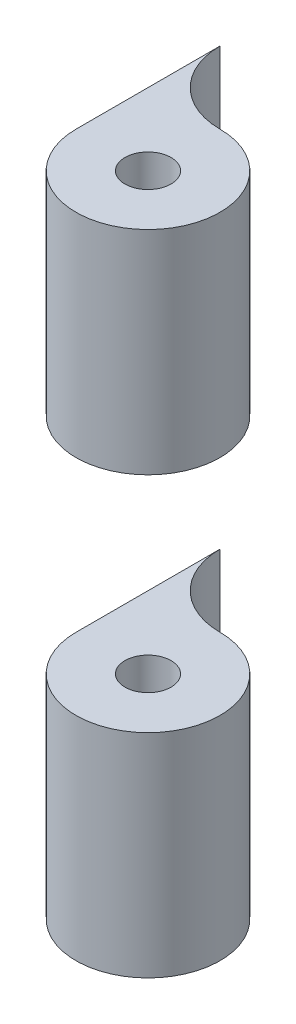
ISO-10303-21;
HEADER;
FILE_DESCRIPTION(('STEP AP214'),'2;1');
FILE_NAME('part.step','',(''),(''),'','','');
FILE_SCHEMA(('AUTOMOTIVE_DESIGN { 1 0 10303 214 1 1 1 1 }'));
ENDSEC;
DATA;
#1=APPLICATION_CONTEXT('core data for automotive mechanical design processes');
#2=APPLICATION_PROTOCOL_DEFINITION('international standard','automotive_design',2000,#1);
#3=PRODUCT_CONTEXT('',#1,'mechanical');
#4=PRODUCT('Part','Part','',(#3));
#5=PRODUCT_RELATED_PRODUCT_CATEGORY('part','',(#4));
#6=PRODUCT_DEFINITION_FORMATION('','',#4);
#7=PRODUCT_DEFINITION_CONTEXT('part definition',#1,'design');
#8=PRODUCT_DEFINITION('design','',#6,#7);
#9=PRODUCT_DEFINITION_SHAPE('','',#8);
#10=(LENGTH_UNIT() NAMED_UNIT(*) SI_UNIT(.MILLI.,.METRE.));
#11=(NAMED_UNIT(*) PLANE_ANGLE_UNIT() SI_UNIT($,.RADIAN.));
#12=(NAMED_UNIT(*) SI_UNIT($,.STERADIAN.) SOLID_ANGLE_UNIT());
#13=UNCERTAINTY_MEASURE_WITH_UNIT(LENGTH_MEASURE(1.E-05),#10,'distance_accuracy_value','');
#14=(GEOMETRIC_REPRESENTATION_CONTEXT(3) GLOBAL_UNCERTAINTY_ASSIGNED_CONTEXT((#13)) GLOBAL_UNIT_ASSIGNED_CONTEXT((#10,
#11,#12)) REPRESENTATION_CONTEXT('',''));
#15=CARTESIAN_POINT('',(0.,0.,0.));
#16=DIRECTION('',(0.,0.,1.));
#17=DIRECTION('',(1.,0.,0.));
#18=AXIS2_PLACEMENT_3D('',#15,#16,#17);
#19=CARTESIAN_POINT('',(80.,65.,100.));
#20=DIRECTION('',(0.,-1.,0.));
#21=DIRECTION('',(0.,0.,-1.));
#22=AXIS2_PLACEMENT_3D('',#19,#20,#21);
#23=CYLINDRICAL_SURFACE('',#22,1.60000000000001);
#24=CARTESIAN_POINT('',(80.,50.25,100.));
#25=DIRECTION('',(0.,1.,0.));
#26=DIRECTION('',(0.,0.,1.));
#27=AXIS2_PLACEMENT_3D('',#24,#25,#26);
#28=CIRCLE('',#27,1.60000000000001);
#29=CARTESIAN_POINT('',(80.,50.25,101.6));
#30=VERTEX_POINT('',#29);
#31=EDGE_CURVE('E96',#30,#30,#28,.T.);
#32=ORIENTED_EDGE('',*,*,#31,.F.);
#33=EDGE_LOOP('',(#32));
#34=FACE_BOUND('',#33,.T.);
#35=CARTESIAN_POINT('',(80.,65.,100.));
#36=DIRECTION('',(0.,1.,0.));
#37=DIRECTION('',(0.,0.,1.));
#38=AXIS2_PLACEMENT_3D('',#35,#36,#37);
#39=CIRCLE('',#38,1.60000000000001);
#40=CARTESIAN_POINT('',(80.,65.,101.6));
#41=VERTEX_POINT('',#40);
#42=EDGE_CURVE('E102',#41,#41,#39,.T.);
#43=ORIENTED_EDGE('',*,*,#42,.T.);
#44=EDGE_LOOP('',(#43));
#45=FACE_BOUND('',#44,.T.);
#46=ADVANCED_FACE('F46',(#34,#45),#23,.F.);
#47=CARTESIAN_POINT('',(80.,50.25,100.));
#48=DIRECTION('',(0.,1.,0.));
#49=DIRECTION('',(0.,0.,-1.));
#50=AXIS2_PLACEMENT_3D('',#47,#48,#49);
#51=PLANE('',#50);
#52=ORIENTED_EDGE('',*,*,#31,.T.);
#53=EDGE_LOOP('',(#52));
#54=FACE_BOUND('',#53,.T.);
#55=CARTESIAN_POINT('',(80.,50.25,100.));
#56=DIRECTION('',(0.,-1.,0.));
#57=DIRECTION('',(0.,0.,-1.));
#58=AXIS2_PLACEMENT_3D('',#55,#56,#57);
#59=CIRCLE('',#58,5.00000000000001);
#60=CARTESIAN_POINT('',(80.,50.25,95.));
#61=VERTEX_POINT('',#60);
#62=CARTESIAN_POINT('',(75.,50.25,100.));
#63=VERTEX_POINT('',#62);
#64=EDGE_CURVE('E88',#61,#63,#59,.T.);
#65=ORIENTED_EDGE('',*,*,#64,.T.);
#66=DIRECTION('',(0.,0.,-1.));
#67=VECTOR('',#66,1.);
#68=CARTESIAN_POINT('',(75.,50.25,100.));
#69=LINE('',#68,#67);
#70=CARTESIAN_POINT('',(75.,50.25,90.));
#71=VERTEX_POINT('',#70);
#72=EDGE_CURVE('E64',#63,#71,#69,.T.);
#73=ORIENTED_EDGE('',*,*,#72,.T.);
#74=CARTESIAN_POINT('',(80.,50.25,90.));
#75=DIRECTION('',(0.,1.,0.));
#76=DIRECTION('',(0.,0.,-1.));
#77=AXIS2_PLACEMENT_3D('',#74,#75,#76);
#78=CIRCLE('',#77,5.00000000000002);
#79=EDGE_CURVE('E85',#71,#61,#78,.T.);
#80=ORIENTED_EDGE('',*,*,#79,.T.);
#81=EDGE_LOOP('',(#65,#73,#80));
#82=FACE_BOUND('',#81,.T.);
#83=ADVANCED_FACE('F87',(#54,#82),#51,.F.);
#84=CARTESIAN_POINT('',(80.,65.,90.));
#85=DIRECTION('',(0.,-1.,0.));
#86=DIRECTION('',(0.,0.,-1.));
#87=AXIS2_PLACEMENT_3D('',#84,#85,#86);
#88=CYLINDRICAL_SURFACE('',#87,5.00000000000002);
#89=DIRECTION('',(0.,-1.,0.));
#90=VECTOR('',#89,1.);
#91=CARTESIAN_POINT('',(80.,65.,95.));
#92=LINE('',#91,#90);
#93=CARTESIAN_POINT('',(80.,65.,95.));
#94=VERTEX_POINT('',#93);
#95=EDGE_CURVE('E90',#94,#61,#92,.T.);
#96=ORIENTED_EDGE('',*,*,#95,.T.);
#97=ORIENTED_EDGE('',*,*,#79,.F.);
#98=DIRECTION('',(0.,-1.,0.));
#99=VECTOR('',#98,1.);
#100=CARTESIAN_POINT('',(75.,65.,90.));
#101=LINE('',#100,#99);
#102=CARTESIAN_POINT('',(75.,65.,90.));
#103=VERTEX_POINT('',#102);
#104=EDGE_CURVE('E12',#103,#71,#101,.T.);
#105=ORIENTED_EDGE('',*,*,#104,.F.);
#106=CARTESIAN_POINT('',(80.,65.,90.));
#107=DIRECTION('',(0.,-1.,0.));
#108=DIRECTION('',(0.,0.,-1.));
#109=AXIS2_PLACEMENT_3D('',#106,#107,#108);
#110=CIRCLE('',#109,5.00000000000002);
#111=EDGE_CURVE('E81',#94,#103,#110,.T.);
#112=ORIENTED_EDGE('',*,*,#111,.F.);
#113=EDGE_LOOP('',(#96,#97,#105,#112));
#114=FACE_BOUND('',#113,.T.);
#115=ADVANCED_FACE('F98',(#114),#88,.F.);
#116=CARTESIAN_POINT('',(80.,65.,100.));
#117=DIRECTION('',(0.,-1.,0.));
#118=DIRECTION('',(0.,0.,-1.));
#119=AXIS2_PLACEMENT_3D('',#116,#117,#118);
#120=CYLINDRICAL_SURFACE('',#119,5.00000000000001);
#121=DIRECTION('',(0.,-1.,0.));
#122=VECTOR('',#121,1.);
#123=CARTESIAN_POINT('',(75.,65.,100.));
#124=LINE('',#123,#122);
#125=CARTESIAN_POINT('',(75.,65.,100.));
#126=VERTEX_POINT('',#125);
#127=EDGE_CURVE('E50',#126,#63,#124,.T.);
#128=ORIENTED_EDGE('',*,*,#127,.T.);
#129=ORIENTED_EDGE('',*,*,#64,.F.);
#130=ORIENTED_EDGE('',*,*,#95,.F.);
#131=CARTESIAN_POINT('',(80.,65.,100.));
#132=DIRECTION('',(0.,1.,0.));
#133=DIRECTION('',(0.,0.,1.));
#134=AXIS2_PLACEMENT_3D('',#131,#132,#133);
#135=CIRCLE('',#134,5.00000000000001);
#136=EDGE_CURVE('E99',#126,#94,#135,.T.);
#137=ORIENTED_EDGE('',*,*,#136,.F.);
#138=EDGE_LOOP('',(#128,#129,#130,#137));
#139=FACE_BOUND('',#138,.T.);
#140=ADVANCED_FACE('F94',(#139),#120,.T.);
#141=CARTESIAN_POINT('',(80.,65.,100.));
#142=DIRECTION('',(0.,1.,0.));
#143=DIRECTION('',(0.,0.,1.));
#144=AXIS2_PLACEMENT_3D('',#141,#142,#143);
#145=PLANE('',#144);
#146=DIRECTION('',(0.,0.,1.));
#147=VECTOR('',#146,1.);
#148=CARTESIAN_POINT('',(75.,65.,100.));
#149=LINE('',#148,#147);
#150=EDGE_CURVE('E56',#103,#126,#149,.T.);
#151=ORIENTED_EDGE('',*,*,#150,.T.);
#152=ORIENTED_EDGE('',*,*,#136,.T.);
#153=ORIENTED_EDGE('',*,*,#111,.T.);
#154=EDGE_LOOP('',(#151,#152,#153));
#155=FACE_BOUND('',#154,.T.);
#156=ORIENTED_EDGE('',*,*,#42,.F.);
#157=EDGE_LOOP('',(#156));
#158=FACE_BOUND('',#157,.T.);
#159=ADVANCED_FACE('F117',(#155,#158),#145,.T.);
#160=CARTESIAN_POINT('',(75.,0.,0.));
#161=DIRECTION('',(1.,0.,0.));
#162=DIRECTION('',(0.,1.,0.));
#163=AXIS2_PLACEMENT_3D('',#160,#161,#162);
#164=PLANE('',#163);
#165=ORIENTED_EDGE('',*,*,#127,.F.);
#166=ORIENTED_EDGE('',*,*,#150,.F.);
#167=ORIENTED_EDGE('',*,*,#104,.T.);
#168=ORIENTED_EDGE('',*,*,#72,.F.);
#169=EDGE_LOOP('',(#165,#166,#167,#168));
#170=FACE_BOUND('',#169,.T.);
#171=ADVANCED_FACE('F48',(#170),#164,.F.);
#172=CLOSED_SHELL('',(#46,#83,#115,#140,#159,#171));
#173=MANIFOLD_SOLID_BREP('B2',#172);
#174=CARTESIAN_POINT('',(80.,65.,100.));
#175=DIRECTION('',(0.,-1.,0.));
#176=DIRECTION('',(0.,0.,-1.));
#177=AXIS2_PLACEMENT_3D('',#174,#175,#176);
#178=CYLINDRICAL_SURFACE('',#177,1.60000000000001);
#179=CARTESIAN_POINT('',(80.,20.,100.));
#180=DIRECTION('',(0.,1.,0.));
#181=DIRECTION('',(0.,0.,1.));
#182=AXIS2_PLACEMENT_3D('',#179,#180,#181);
#183=CIRCLE('',#182,1.60000000000001);
#184=CARTESIAN_POINT('',(80.,20.,101.6));
#185=VERTEX_POINT('',#184);
#186=EDGE_CURVE('E220',#185,#185,#183,.T.);
#187=ORIENTED_EDGE('',*,*,#186,.F.);
#188=EDGE_LOOP('',(#187));
#189=FACE_BOUND('',#188,.T.);
#190=CARTESIAN_POINT('',(80.,34.75,100.));
#191=DIRECTION('',(0.,1.,0.));
#192=DIRECTION('',(0.,0.,1.));
#193=AXIS2_PLACEMENT_3D('',#190,#191,#192);
#194=CIRCLE('',#193,1.60000000000001);
#195=CARTESIAN_POINT('',(80.,34.75,101.6));
#196=VERTEX_POINT('',#195);
#197=EDGE_CURVE('E224',#196,#196,#194,.T.);
#198=ORIENTED_EDGE('',*,*,#197,.T.);
#199=EDGE_LOOP('',(#198));
#200=FACE_BOUND('',#199,.T.);
#201=ADVANCED_FACE('F164',(#189,#200),#178,.F.);
#202=CARTESIAN_POINT('',(80.,20.,100.));
#203=DIRECTION('',(0.,1.,0.));
#204=DIRECTION('',(0.,0.,1.));
#205=AXIS2_PLACEMENT_3D('',#202,#203,#204);
#206=PLANE('',#205);
#207=ORIENTED_EDGE('',*,*,#186,.T.);
#208=EDGE_LOOP('',(#207));
#209=FACE_BOUND('',#208,.T.);
#210=CARTESIAN_POINT('',(80.,20.,100.));
#211=DIRECTION('',(0.,1.,0.));
#212=DIRECTION('',(0.,0.,1.));
#213=AXIS2_PLACEMENT_3D('',#210,#211,#212);
#214=CIRCLE('',#213,5.00000000000001);
#215=CARTESIAN_POINT('',(75.,20.,100.));
#216=VERTEX_POINT('',#215);
#217=CARTESIAN_POINT('',(80.,20.,95.));
#218=VERTEX_POINT('',#217);
#219=EDGE_CURVE('E212',#216,#218,#214,.T.);
#220=ORIENTED_EDGE('',*,*,#219,.F.);
#221=DIRECTION('',(0.,0.,-1.));
#222=VECTOR('',#221,1.);
#223=CARTESIAN_POINT('',(75.,20.,100.));
#224=LINE('',#223,#222);
#225=CARTESIAN_POINT('',(75.,20.,90.));
#226=VERTEX_POINT('',#225);
#227=EDGE_CURVE('E193',#216,#226,#224,.T.);
#228=ORIENTED_EDGE('',*,*,#227,.T.);
#229=CARTESIAN_POINT('',(80.,20.,90.));
#230=DIRECTION('',(0.,-1.,0.));
#231=DIRECTION('',(0.,0.,-1.));
#232=AXIS2_PLACEMENT_3D('',#229,#230,#231);
#233=CIRCLE('',#232,5.00000000000002);
#234=EDGE_CURVE('E216',#218,#226,#233,.T.);
#235=ORIENTED_EDGE('',*,*,#234,.F.);
#236=EDGE_LOOP('',(#220,#228,#235));
#237=FACE_BOUND('',#236,.T.);
#238=ADVANCED_FACE('F230',(#209,#237),#206,.F.);
#239=CARTESIAN_POINT('',(80.,34.75,100.));
#240=DIRECTION('',(0.,1.,0.));
#241=DIRECTION('',(0.,0.,-1.));
#242=AXIS2_PLACEMENT_3D('',#239,#240,#241);
#243=PLANE('',#242);
#244=DIRECTION('',(0.,0.,-1.));
#245=VECTOR('',#244,1.);
#246=CARTESIAN_POINT('',(75.,34.75,100.));
#247=LINE('',#246,#245);
#248=CARTESIAN_POINT('',(75.,34.75,100.));
#249=VERTEX_POINT('',#248);
#250=CARTESIAN_POINT('',(75.,34.75,90.));
#251=VERTEX_POINT('',#250);
#252=EDGE_CURVE('E174',#249,#251,#247,.T.);
#253=ORIENTED_EDGE('',*,*,#252,.F.);
#254=CARTESIAN_POINT('',(80.,34.75,100.));
#255=DIRECTION('',(0.,-1.,0.));
#256=DIRECTION('',(0.,0.,-1.));
#257=AXIS2_PLACEMENT_3D('',#254,#255,#256);
#258=CIRCLE('',#257,5.00000000000001);
#259=CARTESIAN_POINT('',(80.,34.75,95.));
#260=VERTEX_POINT('',#259);
#261=EDGE_CURVE('E205',#260,#249,#258,.T.);
#262=ORIENTED_EDGE('',*,*,#261,.F.);
#263=CARTESIAN_POINT('',(80.,34.75,90.));
#264=DIRECTION('',(0.,1.,0.));
#265=DIRECTION('',(0.,0.,-1.));
#266=AXIS2_PLACEMENT_3D('',#263,#264,#265);
#267=CIRCLE('',#266,5.00000000000002);
#268=EDGE_CURVE('E208',#251,#260,#267,.T.);
#269=ORIENTED_EDGE('',*,*,#268,.F.);
#270=EDGE_LOOP('',(#253,#262,#269));
#271=FACE_BOUND('',#270,.T.);
#272=ORIENTED_EDGE('',*,*,#197,.F.);
#273=EDGE_LOOP('',(#272));
#274=FACE_BOUND('',#273,.T.);
#275=ADVANCED_FACE('F206',(#271,#274),#243,.T.);
#276=CARTESIAN_POINT('',(80.,65.,100.));
#277=DIRECTION('',(0.,-1.,0.));
#278=DIRECTION('',(0.,0.,-1.));
#279=AXIS2_PLACEMENT_3D('',#276,#277,#278);
#280=CYLINDRICAL_SURFACE('',#279,5.00000000000001);
#281=ORIENTED_EDGE('',*,*,#261,.T.);
#282=DIRECTION('',(0.,-1.,0.));
#283=VECTOR('',#282,1.);
#284=CARTESIAN_POINT('',(75.,65.,100.));
#285=LINE('',#284,#283);
#286=EDGE_CURVE('E168',#249,#216,#285,.T.);
#287=ORIENTED_EDGE('',*,*,#286,.T.);
#288=ORIENTED_EDGE('',*,*,#219,.T.);
#289=DIRECTION('',(0.,-1.,0.));
#290=VECTOR('',#289,1.);
#291=CARTESIAN_POINT('',(80.,65.,95.));
#292=LINE('',#291,#290);
#293=EDGE_CURVE('E201',#260,#218,#292,.T.);
#294=ORIENTED_EDGE('',*,*,#293,.F.);
#295=EDGE_LOOP('',(#281,#287,#288,#294));
#296=FACE_BOUND('',#295,.T.);
#297=ADVANCED_FACE('F215',(#296),#280,.T.);
#298=CARTESIAN_POINT('',(80.,65.,90.));
#299=DIRECTION('',(0.,-1.,0.));
#300=DIRECTION('',(0.,0.,-1.));
#301=AXIS2_PLACEMENT_3D('',#298,#299,#300);
#302=CYLINDRICAL_SURFACE('',#301,5.00000000000002);
#303=ORIENTED_EDGE('',*,*,#268,.T.);
#304=ORIENTED_EDGE('',*,*,#293,.T.);
#305=ORIENTED_EDGE('',*,*,#234,.T.);
#306=DIRECTION('',(0.,-1.,0.));
#307=VECTOR('',#306,1.);
#308=CARTESIAN_POINT('',(75.,65.,90.));
#309=LINE('',#308,#307);
#310=EDGE_CURVE('E44',#251,#226,#309,.T.);
#311=ORIENTED_EDGE('',*,*,#310,.F.);
#312=EDGE_LOOP('',(#303,#304,#305,#311));
#313=FACE_BOUND('',#312,.T.);
#314=ADVANCED_FACE('F166',(#313),#302,.F.);
#315=CARTESIAN_POINT('',(75.,0.,0.));
#316=DIRECTION('',(1.,0.,0.));
#317=DIRECTION('',(0.,1.,0.));
#318=AXIS2_PLACEMENT_3D('',#315,#316,#317);
#319=PLANE('',#318);
#320=ORIENTED_EDGE('',*,*,#252,.T.);
#321=ORIENTED_EDGE('',*,*,#310,.T.);
#322=ORIENTED_EDGE('',*,*,#227,.F.);
#323=ORIENTED_EDGE('',*,*,#286,.F.);
#324=EDGE_LOOP('',(#320,#321,#322,#323));
#325=FACE_BOUND('',#324,.T.);
#326=ADVANCED_FACE('F245',(#325),#319,.F.);
#327=CLOSED_SHELL('',(#201,#238,#275,#297,#314,#326));
#328=MANIFOLD_SOLID_BREP('B6',#327);
#329=ADVANCED_BREP_SHAPE_REPRESENTATION('',(#18,#173,#328),#14);
#330=SHAPE_DEFINITION_REPRESENTATION(#9,#329);
ENDSEC;
END-ISO-10303-21;
